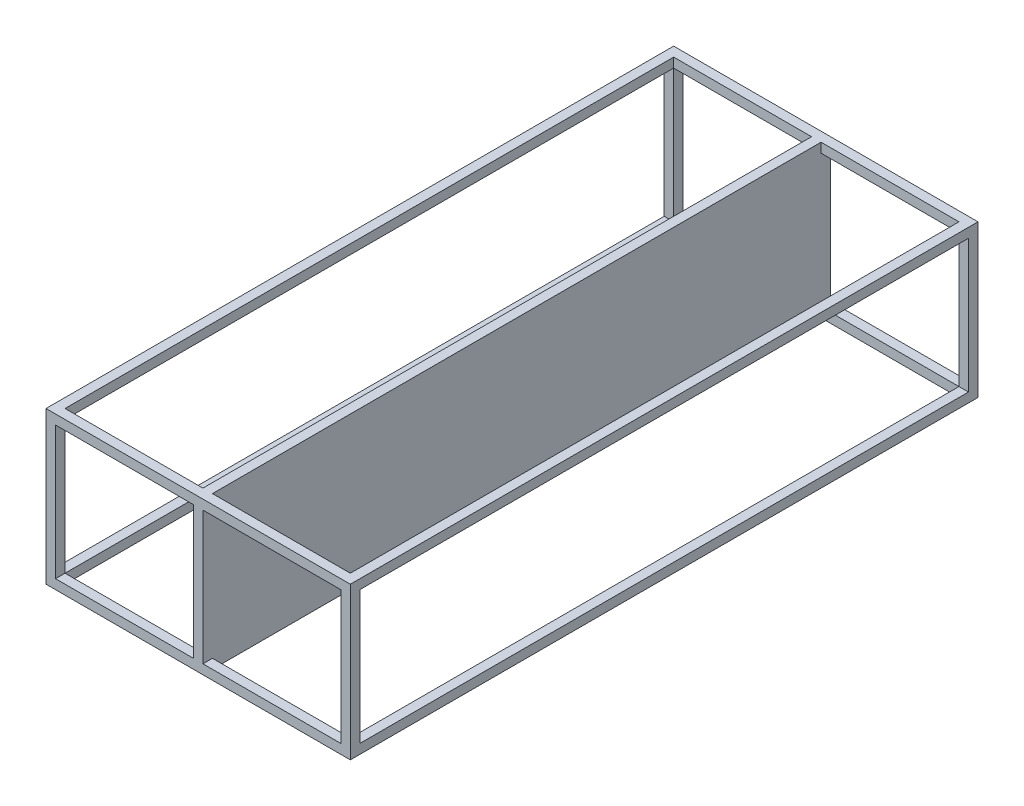
ISO-10303-21;
HEADER;
FILE_DESCRIPTION(('STEP AP214'),'2;1');
FILE_NAME('part.step','',(''),(''),'','','');
FILE_SCHEMA(('AUTOMOTIVE_DESIGN { 1 0 10303 214 1 1 1 1 }'));
ENDSEC;
DATA;
#1=APPLICATION_CONTEXT('core data for automotive mechanical design processes');
#2=APPLICATION_PROTOCOL_DEFINITION('international standard','automotive_design',2000,#1);
#3=PRODUCT_CONTEXT('',#1,'mechanical');
#4=PRODUCT('Part','Part','',(#3));
#5=PRODUCT_RELATED_PRODUCT_CATEGORY('part','',(#4));
#6=PRODUCT_DEFINITION_FORMATION('','',#4);
#7=PRODUCT_DEFINITION_CONTEXT('part definition',#1,'design');
#8=PRODUCT_DEFINITION('design','',#6,#7);
#9=PRODUCT_DEFINITION_SHAPE('','',#8);
#10=(LENGTH_UNIT() NAMED_UNIT(*) SI_UNIT(.MILLI.,.METRE.));
#11=(NAMED_UNIT(*) PLANE_ANGLE_UNIT() SI_UNIT($,.RADIAN.));
#12=(NAMED_UNIT(*) SI_UNIT($,.STERADIAN.) SOLID_ANGLE_UNIT());
#13=UNCERTAINTY_MEASURE_WITH_UNIT(LENGTH_MEASURE(1.E-05),#10,'distance_accuracy_value','');
#14=(GEOMETRIC_REPRESENTATION_CONTEXT(3) GLOBAL_UNCERTAINTY_ASSIGNED_CONTEXT((#13)) GLOBAL_UNIT_ASSIGNED_CONTEXT((#10,
#11,#12)) REPRESENTATION_CONTEXT('',''));
#15=CARTESIAN_POINT('',(0.,0.,0.));
#16=DIRECTION('',(0.,0.,1.));
#17=DIRECTION('',(1.,0.,0.));
#18=AXIS2_PLACEMENT_3D('',#15,#16,#17);
#19=CARTESIAN_POINT('',(0.,0.,5.));
#20=DIRECTION('',(0.,0.,1.));
#21=DIRECTION('',(1.,0.,0.));
#22=AXIS2_PLACEMENT_3D('',#19,#20,#21);
#23=PLANE('',#22);
#24=DIRECTION('',(1.,0.,0.));
#25=VECTOR('',#24,1.);
#26=CARTESIAN_POINT('',(0.,80.,5.));
#27=LINE('',#26,#25);
#28=CARTESIAN_POINT('',(82.5,80.,5.));
#29=VERTEX_POINT('',#28);
#30=CARTESIAN_POINT('',(155.,80.,5.));
#31=VERTEX_POINT('',#30);
#32=EDGE_CURVE('E439',#29,#31,#27,.T.);
#33=ORIENTED_EDGE('',*,*,#32,.F.);
#34=DIRECTION('',(0.,1.,0.));
#35=VECTOR('',#34,1.);
#36=CARTESIAN_POINT('',(82.5,80.,5.));
#37=LINE('',#36,#35);
#38=CARTESIAN_POINT('',(82.5,75.,5.));
#39=VERTEX_POINT('',#38);
#40=EDGE_CURVE('E591',#39,#29,#37,.T.);
#41=ORIENTED_EDGE('',*,*,#40,.F.);
#42=DIRECTION('',(1.,0.,0.));
#43=VECTOR('',#42,1.);
#44=CARTESIAN_POINT('',(0.,75.,5.));
#45=LINE('',#44,#43);
#46=CARTESIAN_POINT('',(155.,75.,5.));
#47=VERTEX_POINT('',#46);
#48=EDGE_CURVE('E423',#39,#47,#45,.T.);
#49=ORIENTED_EDGE('',*,*,#48,.T.);
#50=DIRECTION('',(0.,-1.,0.));
#51=VECTOR('',#50,1.);
#52=CARTESIAN_POINT('',(155.,80.,5.));
#53=LINE('',#52,#51);
#54=EDGE_CURVE('E381',#31,#47,#53,.T.);
#55=ORIENTED_EDGE('',*,*,#54,.F.);
#56=EDGE_LOOP('',(#33,#41,#49,#55));
#57=FACE_BOUND('',#56,.T.);
#58=ADVANCED_FACE('F35',(#57),#23,.T.);
#59=DIRECTION('',(1.,0.,0.));
#60=VECTOR('',#59,1.);
#61=CARTESIAN_POINT('',(0.,4.99999999999999,5.));
#62=LINE('',#61,#60);
#63=CARTESIAN_POINT('',(82.5,4.99999999999999,5.));
#64=VERTEX_POINT('',#63);
#65=CARTESIAN_POINT('',(155.,4.99999999999999,5.));
#66=VERTEX_POINT('',#65);
#67=EDGE_CURVE('E431',#64,#66,#62,.T.);
#68=ORIENTED_EDGE('',*,*,#67,.F.);
#69=CARTESIAN_POINT('',(82.5,0.,5.));
#70=VERTEX_POINT('',#69);
#71=EDGE_CURVE('E511',#70,#64,#37,.T.);
#72=ORIENTED_EDGE('',*,*,#71,.F.);
#73=DIRECTION('',(1.,0.,0.));
#74=VECTOR('',#73,1.);
#75=CARTESIAN_POINT('',(0.,0.,5.));
#76=LINE('',#75,#74);
#77=CARTESIAN_POINT('',(155.,0.,5.));
#78=VERTEX_POINT('',#77);
#79=EDGE_CURVE('E60',#70,#78,#76,.T.);
#80=ORIENTED_EDGE('',*,*,#79,.T.);
#81=DIRECTION('',(0.,-1.,0.));
#82=VECTOR('',#81,1.);
#83=CARTESIAN_POINT('',(155.,0.,5.));
#84=LINE('',#83,#82);
#85=EDGE_CURVE('E366',#66,#78,#84,.T.);
#86=ORIENTED_EDGE('',*,*,#85,.F.);
#87=EDGE_LOOP('',(#68,#72,#80,#86));
#88=FACE_BOUND('',#87,.T.);
#89=ADVANCED_FACE('F515',(#88),#23,.T.);
#90=CARTESIAN_POINT('',(5.00000000000001,0.,5.));
#91=VERTEX_POINT('',#90);
#92=CARTESIAN_POINT('',(77.5,0.,5.));
#93=VERTEX_POINT('',#92);
#94=EDGE_CURVE('E435',#91,#93,#76,.T.);
#95=ORIENTED_EDGE('',*,*,#94,.T.);
#96=DIRECTION('',(0.,-1.,0.));
#97=VECTOR('',#96,1.);
#98=CARTESIAN_POINT('',(77.5,80.,5.));
#99=LINE('',#98,#97);
#100=CARTESIAN_POINT('',(77.5,4.99999999999999,5.));
#101=VERTEX_POINT('',#100);
#102=EDGE_CURVE('E253',#101,#93,#99,.T.);
#103=ORIENTED_EDGE('',*,*,#102,.F.);
#104=CARTESIAN_POINT('',(5.00000000000001,5.,5.));
#105=VERTEX_POINT('',#104);
#106=EDGE_CURVE('E434',#105,#101,#62,.T.);
#107=ORIENTED_EDGE('',*,*,#106,.F.);
#108=DIRECTION('',(0.,1.,0.));
#109=VECTOR('',#108,1.);
#110=CARTESIAN_POINT('',(5.00000000000001,0.,5.));
#111=LINE('',#110,#109);
#112=EDGE_CURVE('E339',#91,#105,#111,.T.);
#113=ORIENTED_EDGE('',*,*,#112,.F.);
#114=EDGE_LOOP('',(#95,#103,#107,#113));
#115=FACE_BOUND('',#114,.T.);
#116=ADVANCED_FACE('F540',(#115),#23,.T.);
#117=CARTESIAN_POINT('',(5.,75.,5.));
#118=VERTEX_POINT('',#117);
#119=CARTESIAN_POINT('',(77.5,75.,5.));
#120=VERTEX_POINT('',#119);
#121=EDGE_CURVE('E428',#118,#120,#45,.T.);
#122=ORIENTED_EDGE('',*,*,#121,.T.);
#123=CARTESIAN_POINT('',(77.5,80.,5.));
#124=VERTEX_POINT('',#123);
#125=EDGE_CURVE('E299',#124,#120,#99,.T.);
#126=ORIENTED_EDGE('',*,*,#125,.F.);
#127=CARTESIAN_POINT('',(5.,80.,5.));
#128=VERTEX_POINT('',#127);
#129=EDGE_CURVE('E440',#128,#124,#27,.T.);
#130=ORIENTED_EDGE('',*,*,#129,.F.);
#131=DIRECTION('',(0.,1.,0.));
#132=VECTOR('',#131,1.);
#133=CARTESIAN_POINT('',(5.,80.,5.));
#134=LINE('',#133,#132);
#135=EDGE_CURVE('E406',#118,#128,#134,.T.);
#136=ORIENTED_EDGE('',*,*,#135,.F.);
#137=EDGE_LOOP('',(#122,#126,#130,#136));
#138=FACE_BOUND('',#137,.T.);
#139=ADVANCED_FACE('F552',(#138),#23,.T.);
#140=CARTESIAN_POINT('',(0.,0.,325.));
#141=DIRECTION('',(0.,0.,-1.));
#142=DIRECTION('',(1.,0.,0.));
#143=AXIS2_PLACEMENT_3D('',#140,#141,#142);
#144=PLANE('',#143);
#145=DIRECTION('',(1.,0.,0.));
#146=VECTOR('',#145,1.);
#147=CARTESIAN_POINT('',(0.,0.,325.));
#148=LINE('',#147,#146);
#149=CARTESIAN_POINT('',(82.5,0.,325.));
#150=VERTEX_POINT('',#149);
#151=CARTESIAN_POINT('',(155.,0.,325.));
#152=VERTEX_POINT('',#151);
#153=EDGE_CURVE('E276',#150,#152,#148,.T.);
#154=ORIENTED_EDGE('',*,*,#153,.F.);
#155=DIRECTION('',(0.,-1.,0.));
#156=VECTOR('',#155,1.);
#157=CARTESIAN_POINT('',(82.5,80.,325.));
#158=LINE('',#157,#156);
#159=CARTESIAN_POINT('',(82.5,4.99999999999999,325.));
#160=VERTEX_POINT('',#159);
#161=EDGE_CURVE('E269',#160,#150,#158,.T.);
#162=ORIENTED_EDGE('',*,*,#161,.F.);
#163=DIRECTION('',(1.,0.,0.));
#164=VECTOR('',#163,1.);
#165=CARTESIAN_POINT('',(0.,4.99999999999999,325.));
#166=LINE('',#165,#164);
#167=CARTESIAN_POINT('',(155.,4.99999999999999,325.));
#168=VERTEX_POINT('',#167);
#169=EDGE_CURVE('E328',#160,#168,#166,.T.);
#170=ORIENTED_EDGE('',*,*,#169,.T.);
#171=DIRECTION('',(0.,-1.,0.));
#172=VECTOR('',#171,1.);
#173=CARTESIAN_POINT('',(155.,0.,325.));
#174=LINE('',#173,#172);
#175=EDGE_CURVE('E365',#168,#152,#174,.T.);
#176=ORIENTED_EDGE('',*,*,#175,.T.);
#177=EDGE_LOOP('',(#154,#162,#170,#176));
#178=FACE_BOUND('',#177,.T.);
#179=ADVANCED_FACE('F561',(#178),#144,.T.);
#180=DIRECTION('',(1.,0.,0.));
#181=VECTOR('',#180,1.);
#182=CARTESIAN_POINT('',(0.,75.,325.));
#183=LINE('',#182,#181);
#184=CARTESIAN_POINT('',(82.5,75.,325.));
#185=VERTEX_POINT('',#184);
#186=CARTESIAN_POINT('',(155.,75.,325.));
#187=VERTEX_POINT('',#186);
#188=EDGE_CURVE('E281',#185,#187,#183,.T.);
#189=ORIENTED_EDGE('',*,*,#188,.F.);
#190=CARTESIAN_POINT('',(82.5,80.,325.));
#191=VERTEX_POINT('',#190);
#192=EDGE_CURVE('E259',#191,#185,#158,.T.);
#193=ORIENTED_EDGE('',*,*,#192,.F.);
#194=DIRECTION('',(1.,0.,0.));
#195=VECTOR('',#194,1.);
#196=CARTESIAN_POINT('',(0.,80.,325.));
#197=LINE('',#196,#195);
#198=CARTESIAN_POINT('',(155.,80.,325.));
#199=VERTEX_POINT('',#198);
#200=EDGE_CURVE('E279',#191,#199,#197,.T.);
#201=ORIENTED_EDGE('',*,*,#200,.T.);
#202=DIRECTION('',(0.,-1.,0.));
#203=VECTOR('',#202,1.);
#204=CARTESIAN_POINT('',(155.,80.,325.));
#205=LINE('',#204,#203);
#206=EDGE_CURVE('E382',#199,#187,#205,.T.);
#207=ORIENTED_EDGE('',*,*,#206,.T.);
#208=EDGE_LOOP('',(#189,#193,#201,#207));
#209=FACE_BOUND('',#208,.T.);
#210=ADVANCED_FACE('F567',(#209),#144,.T.);
#211=CARTESIAN_POINT('',(5.,80.,325.));
#212=VERTEX_POINT('',#211);
#213=CARTESIAN_POINT('',(77.5,80.,325.));
#214=VERTEX_POINT('',#213);
#215=EDGE_CURVE('E285',#212,#214,#197,.T.);
#216=ORIENTED_EDGE('',*,*,#215,.T.);
#217=DIRECTION('',(0.,1.,0.));
#218=VECTOR('',#217,1.);
#219=CARTESIAN_POINT('',(77.5,80.,325.));
#220=LINE('',#219,#218);
#221=CARTESIAN_POINT('',(77.5,75.,325.));
#222=VERTEX_POINT('',#221);
#223=EDGE_CURVE('E270',#222,#214,#220,.T.);
#224=ORIENTED_EDGE('',*,*,#223,.F.);
#225=CARTESIAN_POINT('',(5.,75.,325.));
#226=VERTEX_POINT('',#225);
#227=EDGE_CURVE('E291',#226,#222,#183,.T.);
#228=ORIENTED_EDGE('',*,*,#227,.F.);
#229=DIRECTION('',(0.,1.,0.));
#230=VECTOR('',#229,1.);
#231=CARTESIAN_POINT('',(5.,80.,325.));
#232=LINE('',#231,#230);
#233=EDGE_CURVE('E405',#226,#212,#232,.T.);
#234=ORIENTED_EDGE('',*,*,#233,.T.);
#235=EDGE_LOOP('',(#216,#224,#228,#234));
#236=FACE_BOUND('',#235,.T.);
#237=ADVANCED_FACE('F556',(#236),#144,.T.);
#238=CARTESIAN_POINT('',(5.00000000000001,5.,325.));
#239=VERTEX_POINT('',#238);
#240=CARTESIAN_POINT('',(77.5,4.99999999999999,325.));
#241=VERTEX_POINT('',#240);
#242=EDGE_CURVE('E267',#239,#241,#166,.T.);
#243=ORIENTED_EDGE('',*,*,#242,.T.);
#244=CARTESIAN_POINT('',(77.5,0.,325.));
#245=VERTEX_POINT('',#244);
#246=EDGE_CURVE('E250',#245,#241,#220,.T.);
#247=ORIENTED_EDGE('',*,*,#246,.F.);
#248=CARTESIAN_POINT('',(5.00000000000001,0.,325.));
#249=VERTEX_POINT('',#248);
#250=EDGE_CURVE('E265',#249,#245,#148,.T.);
#251=ORIENTED_EDGE('',*,*,#250,.F.);
#252=DIRECTION('',(0.,1.,0.));
#253=VECTOR('',#252,1.);
#254=CARTESIAN_POINT('',(5.00000000000001,0.,325.));
#255=LINE('',#254,#253);
#256=EDGE_CURVE('E348',#249,#239,#255,.T.);
#257=ORIENTED_EDGE('',*,*,#256,.T.);
#258=EDGE_LOOP('',(#243,#247,#251,#257));
#259=FACE_BOUND('',#258,.T.);
#260=ADVANCED_FACE('F263',(#259),#144,.T.);
#261=DIRECTION('',(0.,1.,0.));
#262=VECTOR('',#261,1.);
#263=CARTESIAN_POINT('',(0.,0.,5.));
#264=LINE('',#263,#262);
#265=CARTESIAN_POINT('',(0.,5.,5.));
#266=VERTEX_POINT('',#265);
#267=CARTESIAN_POINT('',(0.,75.,5.));
#268=VERTEX_POINT('',#267);
#269=EDGE_CURVE('E443',#266,#268,#264,.T.);
#270=ORIENTED_EDGE('',*,*,#269,.F.);
#271=DIRECTION('',(-1.,0.,0.));
#272=VECTOR('',#271,1.);
#273=CARTESIAN_POINT('',(0.,5.,5.));
#274=LINE('',#273,#272);
#275=EDGE_CURVE('E351',#105,#266,#274,.T.);
#276=ORIENTED_EDGE('',*,*,#275,.F.);
#277=DIRECTION('',(0.,-1.,0.));
#278=VECTOR('',#277,1.);
#279=CARTESIAN_POINT('',(5.,0.,5.));
#280=LINE('',#279,#278);
#281=EDGE_CURVE('E445',#118,#105,#280,.T.);
#282=ORIENTED_EDGE('',*,*,#281,.F.);
#283=DIRECTION('',(1.,0.,0.));
#284=VECTOR('',#283,1.);
#285=CARTESIAN_POINT('',(0.,75.,5.));
#286=LINE('',#285,#284);
#287=EDGE_CURVE('E401',#268,#118,#286,.T.);
#288=ORIENTED_EDGE('',*,*,#287,.F.);
#289=EDGE_LOOP('',(#270,#276,#282,#288));
#290=FACE_BOUND('',#289,.T.);
#291=ADVANCED_FACE('F545',(#290),#23,.T.);
#292=DIRECTION('',(0.,-1.,0.));
#293=VECTOR('',#292,1.);
#294=CARTESIAN_POINT('',(155.,0.,5.));
#295=LINE('',#294,#293);
#296=EDGE_CURVE('E426',#47,#66,#295,.T.);
#297=ORIENTED_EDGE('',*,*,#296,.T.);
#298=DIRECTION('',(-1.,0.,0.));
#299=VECTOR('',#298,1.);
#300=CARTESIAN_POINT('',(160.,4.99999999999998,5.));
#301=LINE('',#300,#299);
#302=CARTESIAN_POINT('',(160.,4.99999999999998,5.));
#303=VERTEX_POINT('',#302);
#304=EDGE_CURVE('E361',#303,#66,#301,.T.);
#305=ORIENTED_EDGE('',*,*,#304,.F.);
#306=DIRECTION('',(0.,1.,0.));
#307=VECTOR('',#306,1.);
#308=CARTESIAN_POINT('',(160.,0.,5.));
#309=LINE('',#308,#307);
#310=CARTESIAN_POINT('',(160.,75.,5.));
#311=VERTEX_POINT('',#310);
#312=EDGE_CURVE('E437',#303,#311,#309,.T.);
#313=ORIENTED_EDGE('',*,*,#312,.T.);
#314=DIRECTION('',(1.,0.,0.));
#315=VECTOR('',#314,1.);
#316=CARTESIAN_POINT('',(160.,75.,5.));
#317=LINE('',#316,#315);
#318=EDGE_CURVE('E386',#47,#311,#317,.T.);
#319=ORIENTED_EDGE('',*,*,#318,.F.);
#320=EDGE_LOOP('',(#297,#305,#313,#319));
#321=FACE_BOUND('',#320,.T.);
#322=ADVANCED_FACE('F522',(#321),#23,.T.);
#323=CARTESIAN_POINT('',(0.,75.,5.));
#324=DIRECTION('',(0.,1.,0.));
#325=DIRECTION('',(0.,0.,1.));
#326=AXIS2_PLACEMENT_3D('',#323,#324,#325);
#327=PLANE('',#326);
#328=DIRECTION('',(1.,0.,0.));
#329=VECTOR('',#328,1.);
#330=CARTESIAN_POINT('',(0.,75.,0.));
#331=LINE('',#330,#329);
#332=CARTESIAN_POINT('',(5.,75.,0.));
#333=VERTEX_POINT('',#332);
#334=CARTESIAN_POINT('',(77.5,75.,0.));
#335=VERTEX_POINT('',#334);
#336=EDGE_CURVE('E454',#333,#335,#331,.T.);
#337=ORIENTED_EDGE('',*,*,#336,.T.);
#338=DIRECTION('',(0.,0.,-1.));
#339=VECTOR('',#338,1.);
#340=CARTESIAN_POINT('',(77.5,75.,5.));
#341=LINE('',#340,#339);
#342=EDGE_CURVE('E11',#120,#335,#341,.T.);
#343=ORIENTED_EDGE('',*,*,#342,.F.);
#344=ORIENTED_EDGE('',*,*,#121,.F.);
#345=DIRECTION('',(0.,0.,-1.));
#346=VECTOR('',#345,1.);
#347=CARTESIAN_POINT('',(5.,75.,5.));
#348=LINE('',#347,#346);
#349=EDGE_CURVE('E477',#118,#333,#348,.T.);
#350=ORIENTED_EDGE('',*,*,#349,.T.);
#351=EDGE_LOOP('',(#337,#343,#344,#350));
#352=FACE_BOUND('',#351,.T.);
#353=ADVANCED_FACE('F532',(#352),#327,.F.);
#354=CARTESIAN_POINT('',(77.5,0.,5.));
#355=DIRECTION('',(1.,0.,0.));
#356=DIRECTION('',(0.,0.,-1.));
#357=AXIS2_PLACEMENT_3D('',#354,#355,#356);
#358=PLANE('',#357);
#359=DIRECTION('',(0.,-1.,0.));
#360=VECTOR('',#359,1.);
#361=CARTESIAN_POINT('',(77.5,0.,0.));
#362=LINE('',#361,#360);
#363=CARTESIAN_POINT('',(77.5,4.99999999999999,0.));
#364=VERTEX_POINT('',#363);
#365=EDGE_CURVE('E473',#335,#364,#362,.T.);
#366=ORIENTED_EDGE('',*,*,#365,.T.);
#367=DIRECTION('',(0.,0.,-1.));
#368=VECTOR('',#367,1.);
#369=CARTESIAN_POINT('',(77.5,4.99999999999999,5.));
#370=LINE('',#369,#368);
#371=EDGE_CURVE('E44',#101,#364,#370,.T.);
#372=ORIENTED_EDGE('',*,*,#371,.F.);
#373=ORIENTED_EDGE('',*,*,#102,.T.);
#374=DIRECTION('',(0.,0.,-1.));
#375=VECTOR('',#374,1.);
#376=CARTESIAN_POINT('',(77.5,0.,330.002));
#377=LINE('',#376,#375);
#378=EDGE_CURVE('E246',#245,#93,#377,.T.);
#379=ORIENTED_EDGE('',*,*,#378,.F.);
#380=ORIENTED_EDGE('',*,*,#246,.T.);
#381=DIRECTION('',(0.,0.,1.));
#382=VECTOR('',#381,1.);
#383=CARTESIAN_POINT('',(77.5,4.99999999999999,325.));
#384=LINE('',#383,#382);
#385=CARTESIAN_POINT('',(77.5,4.99999999999999,330.));
#386=VERTEX_POINT('',#385);
#387=EDGE_CURVE('E331',#241,#386,#384,.T.);
#388=ORIENTED_EDGE('',*,*,#387,.T.);
#389=DIRECTION('',(0.,-1.,0.));
#390=VECTOR('',#389,1.);
#391=CARTESIAN_POINT('',(77.5,0.,330.));
#392=LINE('',#391,#390);
#393=CARTESIAN_POINT('',(77.5,75.,330.));
#394=VERTEX_POINT('',#393);
#395=EDGE_CURVE('E325',#394,#386,#392,.T.);
#396=ORIENTED_EDGE('',*,*,#395,.F.);
#397=DIRECTION('',(0.,0.,1.));
#398=VECTOR('',#397,1.);
#399=CARTESIAN_POINT('',(77.5,75.,325.));
#400=LINE('',#399,#398);
#401=EDGE_CURVE('E329',#222,#394,#400,.T.);
#402=ORIENTED_EDGE('',*,*,#401,.F.);
#403=ORIENTED_EDGE('',*,*,#223,.T.);
#404=DIRECTION('',(0.,0.,-1.));
#405=VECTOR('',#404,1.);
#406=CARTESIAN_POINT('',(77.5,80.,330.002));
#407=LINE('',#406,#405);
#408=EDGE_CURVE('E581',#214,#124,#407,.T.);
#409=ORIENTED_EDGE('',*,*,#408,.T.);
#410=ORIENTED_EDGE('',*,*,#125,.T.);
#411=ORIENTED_EDGE('',*,*,#342,.T.);
#412=EDGE_LOOP('',(#366,#372,#373,#379,#380,#388,#396,#402,#403,#409,#410,#411));
#413=FACE_BOUND('',#412,.T.);
#414=ADVANCED_FACE('F249',(#413),#358,.F.);
#415=CARTESIAN_POINT('',(0.,4.99999999999999,5.));
#416=DIRECTION('',(0.,1.,0.));
#417=DIRECTION('',(0.,0.,1.));
#418=AXIS2_PLACEMENT_3D('',#415,#416,#417);
#419=PLANE('',#418);
#420=DIRECTION('',(1.,0.,0.));
#421=VECTOR('',#420,1.);
#422=CARTESIAN_POINT('',(0.,4.99999999999999,0.));
#423=LINE('',#422,#421);
#424=CARTESIAN_POINT('',(5.,4.99999999999999,0.));
#425=VERTEX_POINT('',#424);
#426=EDGE_CURVE('E461',#425,#364,#423,.T.);
#427=ORIENTED_EDGE('',*,*,#426,.F.);
#428=DIRECTION('',(0.,0.,-1.));
#429=VECTOR('',#428,1.);
#430=CARTESIAN_POINT('',(5.,4.99999999999999,5.));
#431=LINE('',#430,#429);
#432=EDGE_CURVE('E479',#105,#425,#431,.T.);
#433=ORIENTED_EDGE('',*,*,#432,.F.);
#434=ORIENTED_EDGE('',*,*,#106,.T.);
#435=ORIENTED_EDGE('',*,*,#371,.T.);
#436=EDGE_LOOP('',(#427,#433,#434,#435));
#437=FACE_BOUND('',#436,.T.);
#438=ADVANCED_FACE('F698',(#437),#419,.T.);
#439=CARTESIAN_POINT('',(0.,0.,5.));
#440=DIRECTION('',(0.,1.,0.));
#441=DIRECTION('',(0.,0.,1.));
#442=AXIS2_PLACEMENT_3D('',#439,#440,#441);
#443=PLANE('',#442);
#444=ORIENTED_EDGE('',*,*,#79,.F.);
#445=DIRECTION('',(0.,0.,-1.));
#446=VECTOR('',#445,1.);
#447=CARTESIAN_POINT('',(82.5,0.,330.002));
#448=LINE('',#447,#446);
#449=EDGE_CURVE('E258',#150,#70,#448,.T.);
#450=ORIENTED_EDGE('',*,*,#449,.F.);
#451=ORIENTED_EDGE('',*,*,#153,.T.);
#452=DIRECTION('',(0.,0.,-1.));
#453=VECTOR('',#452,1.);
#454=CARTESIAN_POINT('',(155.,0.,325.));
#455=LINE('',#454,#453);
#456=EDGE_CURVE('E369',#152,#78,#455,.T.);
#457=ORIENTED_EDGE('',*,*,#456,.T.);
#458=EDGE_LOOP('',(#444,#450,#451,#457));
#459=FACE_BOUND('',#458,.T.);
#460=DIRECTION('',(0.,0.,-1.));
#461=VECTOR('',#460,1.);
#462=CARTESIAN_POINT('',(160.,0.,5.));
#463=LINE('',#462,#461);
#464=CARTESIAN_POINT('',(160.,0.,330.));
#465=VERTEX_POINT('',#464);
#466=CARTESIAN_POINT('',(160.,0.,0.));
#467=VERTEX_POINT('',#466);
#468=EDGE_CURVE('E480',#465,#467,#463,.T.);
#469=ORIENTED_EDGE('',*,*,#468,.F.);
#470=DIRECTION('',(1.,0.,0.));
#471=VECTOR('',#470,1.);
#472=CARTESIAN_POINT('',(0.,0.,330.));
#473=LINE('',#472,#471);
#474=CARTESIAN_POINT('',(0.,0.,330.));
#475=VERTEX_POINT('',#474);
#476=EDGE_CURVE('E309',#475,#465,#473,.T.);
#477=ORIENTED_EDGE('',*,*,#476,.F.);
#478=DIRECTION('',(0.,0.,-1.));
#479=VECTOR('',#478,1.);
#480=CARTESIAN_POINT('',(0.,0.,5.));
#481=LINE('',#480,#479);
#482=CARTESIAN_POINT('',(0.,0.,0.));
#483=VERTEX_POINT('',#482);
#484=EDGE_CURVE('E483',#475,#483,#481,.T.);
#485=ORIENTED_EDGE('',*,*,#484,.T.);
#486=DIRECTION('',(1.,0.,0.));
#487=VECTOR('',#486,1.);
#488=CARTESIAN_POINT('',(0.,0.,0.));
#489=LINE('',#488,#487);
#490=EDGE_CURVE('E460',#483,#467,#489,.T.);
#491=ORIENTED_EDGE('',*,*,#490,.T.);
#492=EDGE_LOOP('',(#469,#477,#485,#491));
#493=FACE_BOUND('',#492,.T.);
#494=ORIENTED_EDGE('',*,*,#250,.T.);
#495=ORIENTED_EDGE('',*,*,#378,.T.);
#496=ORIENTED_EDGE('',*,*,#94,.F.);
#497=DIRECTION('',(0.,0.,-1.));
#498=VECTOR('',#497,1.);
#499=CARTESIAN_POINT('',(5.00000000000001,0.,325.));
#500=LINE('',#499,#498);
#501=EDGE_CURVE('E273',#249,#91,#500,.T.);
#502=ORIENTED_EDGE('',*,*,#501,.F.);
#503=EDGE_LOOP('',(#494,#495,#496,#502));
#504=FACE_BOUND('',#503,.T.);
#505=ADVANCED_FACE('F272',(#459,#493,#504),#443,.F.);
#506=CARTESIAN_POINT('',(160.,0.,5.));
#507=DIRECTION('',(-1.,0.,0.));
#508=DIRECTION('',(0.,-1.,0.));
#509=AXIS2_PLACEMENT_3D('',#506,#507,#508);
#510=PLANE('',#509);
#511=DIRECTION('',(0.,0.,-1.));
#512=VECTOR('',#511,1.);
#513=CARTESIAN_POINT('',(160.,80.,5.));
#514=LINE('',#513,#512);
#515=CARTESIAN_POINT('',(160.,80.,330.));
#516=VERTEX_POINT('',#515);
#517=CARTESIAN_POINT('',(160.,80.,0.));
#518=VERTEX_POINT('',#517);
#519=EDGE_CURVE('E487',#516,#518,#514,.T.);
#520=ORIENTED_EDGE('',*,*,#519,.F.);
#521=DIRECTION('',(0.,1.,0.));
#522=VECTOR('',#521,1.);
#523=CARTESIAN_POINT('',(160.,0.,330.));
#524=LINE('',#523,#522);
#525=EDGE_CURVE('E319',#465,#516,#524,.T.);
#526=ORIENTED_EDGE('',*,*,#525,.F.);
#527=ORIENTED_EDGE('',*,*,#468,.T.);
#528=DIRECTION('',(0.,1.,0.));
#529=VECTOR('',#528,1.);
#530=CARTESIAN_POINT('',(160.,0.,0.));
#531=LINE('',#530,#529);
#532=EDGE_CURVE('E464',#467,#518,#531,.T.);
#533=ORIENTED_EDGE('',*,*,#532,.T.);
#534=EDGE_LOOP('',(#520,#526,#527,#533));
#535=FACE_BOUND('',#534,.T.);
#536=DIRECTION('',(0.,1.,0.));
#537=VECTOR('',#536,1.);
#538=CARTESIAN_POINT('',(160.,0.,325.));
#539=LINE('',#538,#537);
#540=CARTESIAN_POINT('',(160.,4.99999999999999,325.));
#541=VERTEX_POINT('',#540);
#542=CARTESIAN_POINT('',(160.,75.,325.));
#543=VERTEX_POINT('',#542);
#544=EDGE_CURVE('E288',#541,#543,#539,.T.);
#545=ORIENTED_EDGE('',*,*,#544,.T.);
#546=DIRECTION('',(0.,0.,-1.));
#547=VECTOR('',#546,1.);
#548=CARTESIAN_POINT('',(160.,75.,325.));
#549=LINE('',#548,#547);
#550=EDGE_CURVE('E389',#543,#311,#549,.T.);
#551=ORIENTED_EDGE('',*,*,#550,.T.);
#552=ORIENTED_EDGE('',*,*,#312,.F.);
#553=DIRECTION('',(0.,0.,-1.));
#554=VECTOR('',#553,1.);
#555=CARTESIAN_POINT('',(160.,4.99999999999998,325.));
#556=LINE('',#555,#554);
#557=EDGE_CURVE('E378',#541,#303,#556,.T.);
#558=ORIENTED_EDGE('',*,*,#557,.F.);
#559=EDGE_LOOP('',(#545,#551,#552,#558));
#560=FACE_BOUND('',#559,.T.);
#561=ADVANCED_FACE('F636',(#535,#560),#510,.F.);
#562=CARTESIAN_POINT('',(0.,80.,5.));
#563=DIRECTION('',(0.,1.,0.));
#564=DIRECTION('',(0.,0.,1.));
#565=AXIS2_PLACEMENT_3D('',#562,#563,#564);
#566=PLANE('',#565);
#567=ORIENTED_EDGE('',*,*,#129,.T.);
#568=ORIENTED_EDGE('',*,*,#408,.F.);
#569=ORIENTED_EDGE('',*,*,#215,.F.);
#570=DIRECTION('',(0.,0.,-1.));
#571=VECTOR('',#570,1.);
#572=CARTESIAN_POINT('',(5.,80.,325.));
#573=LINE('',#572,#571);
#574=EDGE_CURVE('E409',#212,#128,#573,.T.);
#575=ORIENTED_EDGE('',*,*,#574,.T.);
#576=EDGE_LOOP('',(#567,#568,#569,#575));
#577=FACE_BOUND('',#576,.T.);
#578=DIRECTION('',(0.,0.,-1.));
#579=VECTOR('',#578,1.);
#580=CARTESIAN_POINT('',(0.,80.,5.));
#581=LINE('',#580,#579);
#582=CARTESIAN_POINT('',(0.,80.,330.));
#583=VERTEX_POINT('',#582);
#584=CARTESIAN_POINT('',(0.,80.,0.));
#585=VERTEX_POINT('',#584);
#586=EDGE_CURVE('E485',#583,#585,#581,.T.);
#587=ORIENTED_EDGE('',*,*,#586,.F.);
#588=DIRECTION('',(1.,0.,0.));
#589=VECTOR('',#588,1.);
#590=CARTESIAN_POINT('',(0.,80.,330.));
#591=LINE('',#590,#589);
#592=EDGE_CURVE('E316',#583,#516,#591,.T.);
#593=ORIENTED_EDGE('',*,*,#592,.T.);
#594=ORIENTED_EDGE('',*,*,#519,.T.);
#595=DIRECTION('',(1.,0.,0.));
#596=VECTOR('',#595,1.);
#597=CARTESIAN_POINT('',(0.,80.,0.));
#598=LINE('',#597,#596);
#599=EDGE_CURVE('E467',#585,#518,#598,.T.);
#600=ORIENTED_EDGE('',*,*,#599,.F.);
#601=EDGE_LOOP('',(#587,#593,#594,#600));
#602=FACE_BOUND('',#601,.T.);
#603=DIRECTION('',(0.,0.,-1.));
#604=VECTOR('',#603,1.);
#605=CARTESIAN_POINT('',(82.5,80.,330.002));
#606=LINE('',#605,#604);
#607=EDGE_CURVE('E587',#191,#29,#606,.T.);
#608=ORIENTED_EDGE('',*,*,#607,.T.);
#609=ORIENTED_EDGE('',*,*,#32,.T.);
#610=DIRECTION('',(0.,0.,-1.));
#611=VECTOR('',#610,1.);
#612=CARTESIAN_POINT('',(155.,80.,325.));
#613=LINE('',#612,#611);
#614=EDGE_CURVE('E398',#199,#31,#613,.T.);
#615=ORIENTED_EDGE('',*,*,#614,.F.);
#616=ORIENTED_EDGE('',*,*,#200,.F.);
#617=EDGE_LOOP('',(#608,#609,#615,#616));
#618=FACE_BOUND('',#617,.T.);
#619=ADVANCED_FACE('F633',(#577,#602,#618),#566,.T.);
#620=CARTESIAN_POINT('',(82.5,0.,5.));
#621=DIRECTION('',(1.,0.,0.));
#622=DIRECTION('',(0.,0.,-1.));
#623=AXIS2_PLACEMENT_3D('',#620,#621,#622);
#624=PLANE('',#623);
#625=DIRECTION('',(0.,-1.,0.));
#626=VECTOR('',#625,1.);
#627=CARTESIAN_POINT('',(82.5,0.,0.));
#628=LINE('',#627,#626);
#629=CARTESIAN_POINT('',(82.5,75.,0.));
#630=VERTEX_POINT('',#629);
#631=CARTESIAN_POINT('',(82.5,4.99999999999999,0.));
#632=VERTEX_POINT('',#631);
#633=EDGE_CURVE('E422',#630,#632,#628,.T.);
#634=ORIENTED_EDGE('',*,*,#633,.F.);
#635=DIRECTION('',(0.,0.,-1.));
#636=VECTOR('',#635,1.);
#637=CARTESIAN_POINT('',(82.5,75.,5.));
#638=LINE('',#637,#636);
#639=EDGE_CURVE('E39',#39,#630,#638,.T.);
#640=ORIENTED_EDGE('',*,*,#639,.F.);
#641=ORIENTED_EDGE('',*,*,#40,.T.);
#642=ORIENTED_EDGE('',*,*,#607,.F.);
#643=ORIENTED_EDGE('',*,*,#192,.T.);
#644=DIRECTION('',(0.,0.,1.));
#645=VECTOR('',#644,1.);
#646=CARTESIAN_POINT('',(82.5,75.,325.));
#647=LINE('',#646,#645);
#648=CARTESIAN_POINT('',(82.5,75.,330.));
#649=VERTEX_POINT('',#648);
#650=EDGE_CURVE('E340',#185,#649,#647,.T.);
#651=ORIENTED_EDGE('',*,*,#650,.T.);
#652=DIRECTION('',(0.,-1.,0.));
#653=VECTOR('',#652,1.);
#654=CARTESIAN_POINT('',(82.5,0.,330.));
#655=LINE('',#654,#653);
#656=CARTESIAN_POINT('',(82.5,4.99999999999999,330.));
#657=VERTEX_POINT('',#656);
#658=EDGE_CURVE('E295',#649,#657,#655,.T.);
#659=ORIENTED_EDGE('',*,*,#658,.T.);
#660=DIRECTION('',(0.,0.,1.));
#661=VECTOR('',#660,1.);
#662=CARTESIAN_POINT('',(82.5,4.99999999999999,325.));
#663=LINE('',#662,#661);
#664=EDGE_CURVE('E332',#160,#657,#663,.T.);
#665=ORIENTED_EDGE('',*,*,#664,.F.);
#666=ORIENTED_EDGE('',*,*,#161,.T.);
#667=ORIENTED_EDGE('',*,*,#449,.T.);
#668=ORIENTED_EDGE('',*,*,#71,.T.);
#669=DIRECTION('',(0.,0.,-1.));
#670=VECTOR('',#669,1.);
#671=CARTESIAN_POINT('',(82.5,4.99999999999999,5.));
#672=LINE('',#671,#670);
#673=EDGE_CURVE('E448',#64,#632,#672,.T.);
#674=ORIENTED_EDGE('',*,*,#673,.T.);
#675=EDGE_LOOP('',(#634,#640,#641,#642,#643,#651,#659,#665,#666,#667,#668,#674));
#676=FACE_BOUND('',#675,.T.);
#677=ADVANCED_FACE('F37',(#676),#624,.T.);
#678=CARTESIAN_POINT('',(155.,75.,0.));
#679=VERTEX_POINT('',#678);
#680=EDGE_CURVE('E451',#630,#679,#331,.T.);
#681=ORIENTED_EDGE('',*,*,#680,.T.);
#682=DIRECTION('',(0.,0.,-1.));
#683=VECTOR('',#682,1.);
#684=CARTESIAN_POINT('',(155.,75.,5.));
#685=LINE('',#684,#683);
#686=EDGE_CURVE('E493',#47,#679,#685,.T.);
#687=ORIENTED_EDGE('',*,*,#686,.F.);
#688=ORIENTED_EDGE('',*,*,#48,.F.);
#689=ORIENTED_EDGE('',*,*,#639,.T.);
#690=EDGE_LOOP('',(#681,#687,#688,#689));
#691=FACE_BOUND('',#690,.T.);
#692=ADVANCED_FACE('F503',(#691),#327,.F.);
#693=CARTESIAN_POINT('',(155.,0.,5.));
#694=DIRECTION('',(1.,0.,0.));
#695=DIRECTION('',(0.,0.,-1.));
#696=AXIS2_PLACEMENT_3D('',#693,#694,#695);
#697=PLANE('',#696);
#698=DIRECTION('',(0.,-1.,0.));
#699=VECTOR('',#698,1.);
#700=CARTESIAN_POINT('',(155.,0.,0.));
#701=LINE('',#700,#699);
#702=CARTESIAN_POINT('',(155.,4.99999999999999,0.));
#703=VERTEX_POINT('',#702);
#704=EDGE_CURVE('E453',#679,#703,#701,.T.);
#705=ORIENTED_EDGE('',*,*,#704,.T.);
#706=DIRECTION('',(0.,0.,-1.));
#707=VECTOR('',#706,1.);
#708=CARTESIAN_POINT('',(155.,4.99999999999999,5.));
#709=LINE('',#708,#707);
#710=EDGE_CURVE('E492',#66,#703,#709,.T.);
#711=ORIENTED_EDGE('',*,*,#710,.F.);
#712=ORIENTED_EDGE('',*,*,#296,.F.);
#713=ORIENTED_EDGE('',*,*,#686,.T.);
#714=EDGE_LOOP('',(#705,#711,#712,#713));
#715=FACE_BOUND('',#714,.T.);
#716=ADVANCED_FACE('F523',(#715),#697,.F.);
#717=CARTESIAN_POINT('',(0.,0.,5.));
#718=DIRECTION('',(-1.,0.,0.));
#719=DIRECTION('',(0.,0.,1.));
#720=AXIS2_PLACEMENT_3D('',#717,#718,#719);
#721=PLANE('',#720);
#722=DIRECTION('',(0.,0.,-1.));
#723=VECTOR('',#722,1.);
#724=CARTESIAN_POINT('',(0.,75.,325.));
#725=LINE('',#724,#723);
#726=CARTESIAN_POINT('',(0.,75.,325.));
#727=VERTEX_POINT('',#726);
#728=EDGE_CURVE('E419',#727,#268,#725,.T.);
#729=ORIENTED_EDGE('',*,*,#728,.F.);
#730=DIRECTION('',(0.,1.,0.));
#731=VECTOR('',#730,1.);
#732=CARTESIAN_POINT('',(0.,0.,325.));
#733=LINE('',#732,#731);
#734=CARTESIAN_POINT('',(0.,5.,325.));
#735=VERTEX_POINT('',#734);
#736=EDGE_CURVE('E275',#735,#727,#733,.T.);
#737=ORIENTED_EDGE('',*,*,#736,.F.);
#738=DIRECTION('',(0.,0.,-1.));
#739=VECTOR('',#738,1.);
#740=CARTESIAN_POINT('',(0.,5.,325.));
#741=LINE('',#740,#739);
#742=EDGE_CURVE('E52',#735,#266,#741,.T.);
#743=ORIENTED_EDGE('',*,*,#742,.T.);
#744=ORIENTED_EDGE('',*,*,#269,.T.);
#745=EDGE_LOOP('',(#729,#737,#743,#744));
#746=FACE_BOUND('',#745,.T.);
#747=DIRECTION('',(0.,1.,0.));
#748=VECTOR('',#747,1.);
#749=CARTESIAN_POINT('',(0.,0.,0.));
#750=LINE('',#749,#748);
#751=EDGE_CURVE('E470',#483,#585,#750,.T.);
#752=ORIENTED_EDGE('',*,*,#751,.F.);
#753=ORIENTED_EDGE('',*,*,#484,.F.);
#754=DIRECTION('',(0.,1.,0.));
#755=VECTOR('',#754,1.);
#756=CARTESIAN_POINT('',(0.,0.,330.));
#757=LINE('',#756,#755);
#758=EDGE_CURVE('E313',#475,#583,#757,.T.);
#759=ORIENTED_EDGE('',*,*,#758,.T.);
#760=ORIENTED_EDGE('',*,*,#586,.T.);
#761=EDGE_LOOP('',(#752,#753,#759,#760));
#762=FACE_BOUND('',#761,.T.);
#763=ADVANCED_FACE('F525',(#746,#762),#721,.T.);
#764=EDGE_CURVE('E457',#632,#703,#423,.T.);
#765=ORIENTED_EDGE('',*,*,#764,.F.);
#766=ORIENTED_EDGE('',*,*,#673,.F.);
#767=ORIENTED_EDGE('',*,*,#67,.T.);
#768=ORIENTED_EDGE('',*,*,#710,.T.);
#769=EDGE_LOOP('',(#765,#766,#767,#768));
#770=FACE_BOUND('',#769,.T.);
#771=ADVANCED_FACE('F514',(#770),#419,.T.);
#772=CARTESIAN_POINT('',(5.,0.,5.));
#773=DIRECTION('',(1.,0.,0.));
#774=DIRECTION('',(0.,0.,-1.));
#775=AXIS2_PLACEMENT_3D('',#772,#773,#774);
#776=PLANE('',#775);
#777=DIRECTION('',(0.,-1.,0.));
#778=VECTOR('',#777,1.);
#779=CARTESIAN_POINT('',(5.,0.,0.));
#780=LINE('',#779,#778);
#781=EDGE_CURVE('E427',#333,#425,#780,.T.);
#782=ORIENTED_EDGE('',*,*,#781,.F.);
#783=ORIENTED_EDGE('',*,*,#349,.F.);
#784=ORIENTED_EDGE('',*,*,#281,.T.);
#785=ORIENTED_EDGE('',*,*,#432,.T.);
#786=EDGE_LOOP('',(#782,#783,#784,#785));
#787=FACE_BOUND('',#786,.T.);
#788=ADVANCED_FACE('F691',(#787),#776,.T.);
#789=CARTESIAN_POINT('',(0.,0.,0.));
#790=DIRECTION('',(0.,0.,1.));
#791=DIRECTION('',(1.,0.,0.));
#792=AXIS2_PLACEMENT_3D('',#789,#790,#791);
#793=PLANE('',#792);
#794=ORIENTED_EDGE('',*,*,#633,.T.);
#795=ORIENTED_EDGE('',*,*,#764,.T.);
#796=ORIENTED_EDGE('',*,*,#704,.F.);
#797=ORIENTED_EDGE('',*,*,#680,.F.);
#798=EDGE_LOOP('',(#794,#795,#796,#797));
#799=FACE_BOUND('',#798,.T.);
#800=ORIENTED_EDGE('',*,*,#490,.F.);
#801=ORIENTED_EDGE('',*,*,#751,.T.);
#802=ORIENTED_EDGE('',*,*,#599,.T.);
#803=ORIENTED_EDGE('',*,*,#532,.F.);
#804=EDGE_LOOP('',(#800,#801,#802,#803));
#805=FACE_BOUND('',#804,.T.);
#806=ORIENTED_EDGE('',*,*,#336,.F.);
#807=ORIENTED_EDGE('',*,*,#781,.T.);
#808=ORIENTED_EDGE('',*,*,#426,.T.);
#809=ORIENTED_EDGE('',*,*,#365,.F.);
#810=EDGE_LOOP('',(#806,#807,#808,#809));
#811=FACE_BOUND('',#810,.T.);
#812=ADVANCED_FACE('F507',(#799,#805,#811),#793,.F.);
#813=CARTESIAN_POINT('',(0.,75.,325.));
#814=DIRECTION('',(0.,1.,0.));
#815=DIRECTION('',(0.,0.,1.));
#816=AXIS2_PLACEMENT_3D('',#813,#814,#815);
#817=PLANE('',#816);
#818=ORIENTED_EDGE('',*,*,#287,.T.);
#819=DIRECTION('',(0.,0.,-1.));
#820=VECTOR('',#819,1.);
#821=CARTESIAN_POINT('',(5.,75.,325.));
#822=LINE('',#821,#820);
#823=EDGE_CURVE('E416',#226,#118,#822,.T.);
#824=ORIENTED_EDGE('',*,*,#823,.F.);
#825=DIRECTION('',(1.,0.,0.));
#826=VECTOR('',#825,1.);
#827=CARTESIAN_POINT('',(0.,75.,325.));
#828=LINE('',#827,#826);
#829=EDGE_CURVE('E402',#727,#226,#828,.T.);
#830=ORIENTED_EDGE('',*,*,#829,.F.);
#831=ORIENTED_EDGE('',*,*,#728,.T.);
#832=EDGE_LOOP('',(#818,#824,#830,#831));
#833=FACE_BOUND('',#832,.T.);
#834=ADVANCED_FACE('F626',(#833),#817,.F.);
#835=CARTESIAN_POINT('',(5.,80.,325.));
#836=DIRECTION('',(-1.,0.,0.));
#837=DIRECTION('',(0.,0.,1.));
#838=AXIS2_PLACEMENT_3D('',#835,#836,#837);
#839=PLANE('',#838);
#840=ORIENTED_EDGE('',*,*,#135,.T.);
#841=ORIENTED_EDGE('',*,*,#574,.F.);
#842=ORIENTED_EDGE('',*,*,#233,.F.);
#843=ORIENTED_EDGE('',*,*,#823,.T.);
#844=EDGE_LOOP('',(#840,#841,#842,#843));
#845=FACE_BOUND('',#844,.T.);
#846=ADVANCED_FACE('F631',(#845),#839,.F.);
#847=CARTESIAN_POINT('',(155.,80.,325.));
#848=DIRECTION('',(1.,0.,0.));
#849=DIRECTION('',(0.,0.,-1.));
#850=AXIS2_PLACEMENT_3D('',#847,#848,#849);
#851=PLANE('',#850);
#852=ORIENTED_EDGE('',*,*,#54,.T.);
#853=DIRECTION('',(0.,0.,-1.));
#854=VECTOR('',#853,1.);
#855=CARTESIAN_POINT('',(155.,75.,325.));
#856=LINE('',#855,#854);
#857=EDGE_CURVE('E396',#187,#47,#856,.T.);
#858=ORIENTED_EDGE('',*,*,#857,.F.);
#859=ORIENTED_EDGE('',*,*,#206,.F.);
#860=ORIENTED_EDGE('',*,*,#614,.T.);
#861=EDGE_LOOP('',(#852,#858,#859,#860));
#862=FACE_BOUND('',#861,.T.);
#863=ADVANCED_FACE('F646',(#862),#851,.F.);
#864=CARTESIAN_POINT('',(160.,75.,325.));
#865=DIRECTION('',(0.,1.,0.));
#866=DIRECTION('',(0.,0.,1.));
#867=AXIS2_PLACEMENT_3D('',#864,#865,#866);
#868=PLANE('',#867);
#869=ORIENTED_EDGE('',*,*,#318,.T.);
#870=ORIENTED_EDGE('',*,*,#550,.F.);
#871=DIRECTION('',(1.,0.,0.));
#872=VECTOR('',#871,1.);
#873=CARTESIAN_POINT('',(160.,75.,325.));
#874=LINE('',#873,#872);
#875=EDGE_CURVE('E385',#187,#543,#874,.T.);
#876=ORIENTED_EDGE('',*,*,#875,.F.);
#877=ORIENTED_EDGE('',*,*,#857,.T.);
#878=EDGE_LOOP('',(#869,#870,#876,#877));
#879=FACE_BOUND('',#878,.T.);
#880=ADVANCED_FACE('F675',(#879),#868,.F.);
#881=CARTESIAN_POINT('',(160.,4.99999999999998,325.));
#882=DIRECTION('',(0.,-1.,0.));
#883=DIRECTION('',(1.,0.,0.));
#884=AXIS2_PLACEMENT_3D('',#881,#882,#883);
#885=PLANE('',#884);
#886=ORIENTED_EDGE('',*,*,#304,.T.);
#887=DIRECTION('',(0.,0.,-1.));
#888=VECTOR('',#887,1.);
#889=CARTESIAN_POINT('',(155.,4.99999999999999,325.));
#890=LINE('',#889,#888);
#891=EDGE_CURVE('E375',#168,#66,#890,.T.);
#892=ORIENTED_EDGE('',*,*,#891,.F.);
#893=DIRECTION('',(-1.,0.,0.));
#894=VECTOR('',#893,1.);
#895=CARTESIAN_POINT('',(160.,4.99999999999998,325.));
#896=LINE('',#895,#894);
#897=EDGE_CURVE('E362',#541,#168,#896,.T.);
#898=ORIENTED_EDGE('',*,*,#897,.F.);
#899=ORIENTED_EDGE('',*,*,#557,.T.);
#900=EDGE_LOOP('',(#886,#892,#898,#899));
#901=FACE_BOUND('',#900,.T.);
#902=ADVANCED_FACE('F672',(#901),#885,.F.);
#903=CARTESIAN_POINT('',(155.,0.,325.));
#904=DIRECTION('',(1.,0.,0.));
#905=DIRECTION('',(0.,0.,-1.));
#906=AXIS2_PLACEMENT_3D('',#903,#904,#905);
#907=PLANE('',#906);
#908=ORIENTED_EDGE('',*,*,#85,.T.);
#909=ORIENTED_EDGE('',*,*,#456,.F.);
#910=ORIENTED_EDGE('',*,*,#175,.F.);
#911=ORIENTED_EDGE('',*,*,#891,.T.);
#912=EDGE_LOOP('',(#908,#909,#910,#911));
#913=FACE_BOUND('',#912,.T.);
#914=ADVANCED_FACE('F671',(#913),#907,.F.);
#915=CARTESIAN_POINT('',(5.00000000000001,0.,325.));
#916=DIRECTION('',(-1.,0.,0.));
#917=DIRECTION('',(0.,0.,1.));
#918=AXIS2_PLACEMENT_3D('',#915,#916,#917);
#919=PLANE('',#918);
#920=ORIENTED_EDGE('',*,*,#112,.T.);
#921=DIRECTION('',(0.,0.,-1.));
#922=VECTOR('',#921,1.);
#923=CARTESIAN_POINT('',(5.00000000000001,5.,325.));
#924=LINE('',#923,#922);
#925=EDGE_CURVE('E357',#239,#105,#924,.T.);
#926=ORIENTED_EDGE('',*,*,#925,.F.);
#927=ORIENTED_EDGE('',*,*,#256,.F.);
#928=ORIENTED_EDGE('',*,*,#501,.T.);
#929=EDGE_LOOP('',(#920,#926,#927,#928));
#930=FACE_BOUND('',#929,.T.);
#931=ADVANCED_FACE('F935',(#930),#919,.F.);
#932=CARTESIAN_POINT('',(0.,5.,325.));
#933=DIRECTION('',(0.,-1.,0.));
#934=DIRECTION('',(0.,0.,-1.));
#935=AXIS2_PLACEMENT_3D('',#932,#933,#934);
#936=PLANE('',#935);
#937=ORIENTED_EDGE('',*,*,#275,.T.);
#938=ORIENTED_EDGE('',*,*,#742,.F.);
#939=DIRECTION('',(-1.,0.,0.));
#940=VECTOR('',#939,1.);
#941=CARTESIAN_POINT('',(0.,5.,325.));
#942=LINE('',#941,#940);
#943=EDGE_CURVE('E350',#239,#735,#942,.T.);
#944=ORIENTED_EDGE('',*,*,#943,.F.);
#945=ORIENTED_EDGE('',*,*,#925,.T.);
#946=EDGE_LOOP('',(#937,#938,#944,#945));
#947=FACE_BOUND('',#946,.T.);
#948=ADVANCED_FACE('F925',(#947),#936,.F.);
#949=ORIENTED_EDGE('',*,*,#829,.T.);
#950=DIRECTION('',(0.,-1.,0.));
#951=VECTOR('',#950,1.);
#952=CARTESIAN_POINT('',(5.,0.,325.));
#953=LINE('',#952,#951);
#954=EDGE_CURVE('E292',#226,#239,#953,.T.);
#955=ORIENTED_EDGE('',*,*,#954,.T.);
#956=ORIENTED_EDGE('',*,*,#943,.T.);
#957=ORIENTED_EDGE('',*,*,#736,.T.);
#958=EDGE_LOOP('',(#949,#955,#956,#957));
#959=FACE_BOUND('',#958,.T.);
#960=ADVANCED_FACE('F569',(#959),#144,.T.);
#961=ORIENTED_EDGE('',*,*,#875,.T.);
#962=ORIENTED_EDGE('',*,*,#544,.F.);
#963=ORIENTED_EDGE('',*,*,#897,.T.);
#964=DIRECTION('',(0.,-1.,0.));
#965=VECTOR('',#964,1.);
#966=CARTESIAN_POINT('',(155.,0.,325.));
#967=LINE('',#966,#965);
#968=EDGE_CURVE('E593',#187,#168,#967,.T.);
#969=ORIENTED_EDGE('',*,*,#968,.F.);
#970=EDGE_LOOP('',(#961,#962,#963,#969));
#971=FACE_BOUND('',#970,.T.);
#972=ADVANCED_FACE('F558',(#971),#144,.T.);
#973=CARTESIAN_POINT('',(0.,75.,325.));
#974=DIRECTION('',(0.,-1.,0.));
#975=DIRECTION('',(0.,0.,-1.));
#976=AXIS2_PLACEMENT_3D('',#973,#974,#975);
#977=PLANE('',#976);
#978=DIRECTION('',(1.,0.,0.));
#979=VECTOR('',#978,1.);
#980=CARTESIAN_POINT('',(0.,75.,330.));
#981=LINE('',#980,#979);
#982=CARTESIAN_POINT('',(5.,75.,330.));
#983=VERTEX_POINT('',#982);
#984=EDGE_CURVE('E310',#983,#394,#981,.T.);
#985=ORIENTED_EDGE('',*,*,#984,.F.);
#986=DIRECTION('',(0.,0.,1.));
#987=VECTOR('',#986,1.);
#988=CARTESIAN_POINT('',(5.,75.,325.));
#989=LINE('',#988,#987);
#990=EDGE_CURVE('E337',#226,#983,#989,.T.);
#991=ORIENTED_EDGE('',*,*,#990,.F.);
#992=ORIENTED_EDGE('',*,*,#227,.T.);
#993=ORIENTED_EDGE('',*,*,#401,.T.);
#994=EDGE_LOOP('',(#985,#991,#992,#993));
#995=FACE_BOUND('',#994,.T.);
#996=ADVANCED_FACE('F607',(#995),#977,.T.);
#997=CARTESIAN_POINT('',(5.,0.,325.));
#998=DIRECTION('',(-1.,0.,0.));
#999=DIRECTION('',(0.,0.,1.));
#1000=AXIS2_PLACEMENT_3D('',#997,#998,#999);
#1001=PLANE('',#1000);
#1002=DIRECTION('',(0.,-1.,0.));
#1003=VECTOR('',#1002,1.);
#1004=CARTESIAN_POINT('',(5.,0.,330.));
#1005=LINE('',#1004,#1003);
#1006=CARTESIAN_POINT('',(5.,4.99999999999999,330.));
#1007=VERTEX_POINT('',#1006);
#1008=EDGE_CURVE('E322',#983,#1007,#1005,.T.);
#1009=ORIENTED_EDGE('',*,*,#1008,.T.);
#1010=DIRECTION('',(0.,0.,1.));
#1011=VECTOR('',#1010,1.);
#1012=CARTESIAN_POINT('',(5.,4.99999999999999,325.));
#1013=LINE('',#1012,#1011);
#1014=EDGE_CURVE('E334',#239,#1007,#1013,.T.);
#1015=ORIENTED_EDGE('',*,*,#1014,.F.);
#1016=ORIENTED_EDGE('',*,*,#954,.F.);
#1017=ORIENTED_EDGE('',*,*,#990,.T.);
#1018=EDGE_LOOP('',(#1009,#1015,#1016,#1017));
#1019=FACE_BOUND('',#1018,.T.);
#1020=ADVANCED_FACE('F621',(#1019),#1001,.F.);
#1021=CARTESIAN_POINT('',(0.,4.99999999999999,325.));
#1022=DIRECTION('',(0.,-1.,0.));
#1023=DIRECTION('',(0.,0.,-1.));
#1024=AXIS2_PLACEMENT_3D('',#1021,#1022,#1023);
#1025=PLANE('',#1024);
#1026=DIRECTION('',(1.,0.,0.));
#1027=VECTOR('',#1026,1.);
#1028=CARTESIAN_POINT('',(0.,4.99999999999999,330.));
#1029=LINE('',#1028,#1027);
#1030=EDGE_CURVE('E303',#1007,#386,#1029,.T.);
#1031=ORIENTED_EDGE('',*,*,#1030,.T.);
#1032=ORIENTED_EDGE('',*,*,#387,.F.);
#1033=ORIENTED_EDGE('',*,*,#242,.F.);
#1034=ORIENTED_EDGE('',*,*,#1014,.T.);
#1035=EDGE_LOOP('',(#1031,#1032,#1033,#1034));
#1036=FACE_BOUND('',#1035,.T.);
#1037=ADVANCED_FACE('F758',(#1036),#1025,.F.);
#1038=CARTESIAN_POINT('',(155.,4.99999999999999,330.));
#1039=VERTEX_POINT('',#1038);
#1040=EDGE_CURVE('E298',#657,#1039,#1029,.T.);
#1041=ORIENTED_EDGE('',*,*,#1040,.T.);
#1042=DIRECTION('',(0.,0.,1.));
#1043=VECTOR('',#1042,1.);
#1044=CARTESIAN_POINT('',(155.,4.99999999999999,325.));
#1045=LINE('',#1044,#1043);
#1046=EDGE_CURVE('E344',#168,#1039,#1045,.T.);
#1047=ORIENTED_EDGE('',*,*,#1046,.F.);
#1048=ORIENTED_EDGE('',*,*,#169,.F.);
#1049=ORIENTED_EDGE('',*,*,#664,.T.);
#1050=EDGE_LOOP('',(#1041,#1047,#1048,#1049));
#1051=FACE_BOUND('',#1050,.T.);
#1052=ADVANCED_FACE('F663',(#1051),#1025,.F.);
#1053=CARTESIAN_POINT('',(155.,0.,325.));
#1054=DIRECTION('',(-1.,0.,0.));
#1055=DIRECTION('',(0.,0.,1.));
#1056=AXIS2_PLACEMENT_3D('',#1053,#1054,#1055);
#1057=PLANE('',#1056);
#1058=DIRECTION('',(0.,-1.,0.));
#1059=VECTOR('',#1058,1.);
#1060=CARTESIAN_POINT('',(155.,0.,330.));
#1061=LINE('',#1060,#1059);
#1062=CARTESIAN_POINT('',(155.,75.,330.));
#1063=VERTEX_POINT('',#1062);
#1064=EDGE_CURVE('E302',#1063,#1039,#1061,.T.);
#1065=ORIENTED_EDGE('',*,*,#1064,.F.);
#1066=DIRECTION('',(0.,0.,1.));
#1067=VECTOR('',#1066,1.);
#1068=CARTESIAN_POINT('',(155.,75.,325.));
#1069=LINE('',#1068,#1067);
#1070=EDGE_CURVE('E342',#187,#1063,#1069,.T.);
#1071=ORIENTED_EDGE('',*,*,#1070,.F.);
#1072=ORIENTED_EDGE('',*,*,#968,.T.);
#1073=ORIENTED_EDGE('',*,*,#1046,.T.);
#1074=EDGE_LOOP('',(#1065,#1071,#1072,#1073));
#1075=FACE_BOUND('',#1074,.T.);
#1076=ADVANCED_FACE('F651',(#1075),#1057,.T.);
#1077=EDGE_CURVE('E306',#649,#1063,#981,.T.);
#1078=ORIENTED_EDGE('',*,*,#1077,.F.);
#1079=ORIENTED_EDGE('',*,*,#650,.F.);
#1080=ORIENTED_EDGE('',*,*,#188,.T.);
#1081=ORIENTED_EDGE('',*,*,#1070,.T.);
#1082=EDGE_LOOP('',(#1078,#1079,#1080,#1081));
#1083=FACE_BOUND('',#1082,.T.);
#1084=ADVANCED_FACE('F667',(#1083),#977,.T.);
#1085=CARTESIAN_POINT('',(0.,0.,330.));
#1086=DIRECTION('',(0.,0.,-1.));
#1087=DIRECTION('',(1.,0.,0.));
#1088=AXIS2_PLACEMENT_3D('',#1085,#1086,#1087);
#1089=PLANE('',#1088);
#1090=ORIENTED_EDGE('',*,*,#658,.F.);
#1091=ORIENTED_EDGE('',*,*,#1077,.T.);
#1092=ORIENTED_EDGE('',*,*,#1064,.T.);
#1093=ORIENTED_EDGE('',*,*,#1040,.F.);
#1094=EDGE_LOOP('',(#1090,#1091,#1092,#1093));
#1095=FACE_BOUND('',#1094,.T.);
#1096=ORIENTED_EDGE('',*,*,#476,.T.);
#1097=ORIENTED_EDGE('',*,*,#525,.T.);
#1098=ORIENTED_EDGE('',*,*,#592,.F.);
#1099=ORIENTED_EDGE('',*,*,#758,.F.);
#1100=EDGE_LOOP('',(#1096,#1097,#1098,#1099));
#1101=FACE_BOUND('',#1100,.T.);
#1102=ORIENTED_EDGE('',*,*,#984,.T.);
#1103=ORIENTED_EDGE('',*,*,#395,.T.);
#1104=ORIENTED_EDGE('',*,*,#1030,.F.);
#1105=ORIENTED_EDGE('',*,*,#1008,.F.);
#1106=EDGE_LOOP('',(#1102,#1103,#1104,#1105));
#1107=FACE_BOUND('',#1106,.T.);
#1108=ADVANCED_FACE('F617',(#1095,#1101,#1107),#1089,.F.);
#1109=CLOSED_SHELL('',(#58,#89,#116,#139,#179,#210,#237,#260,#291,#322,#353,#414,#438,#505,#561,
#619,#677,#692,#716,#763,#771,#788,#812,#834,#846,#863,#880,#902,#914,#931,#948,#960,#972,#996,
#1020,#1037,#1052,#1076,#1084,#1108));
#1110=MANIFOLD_SOLID_BREP('B2',#1109);
#1111=ADVANCED_BREP_SHAPE_REPRESENTATION('',(#18,#1110),#14);
#1112=SHAPE_DEFINITION_REPRESENTATION(#9,#1111);
ENDSEC;
END-ISO-10303-21;
